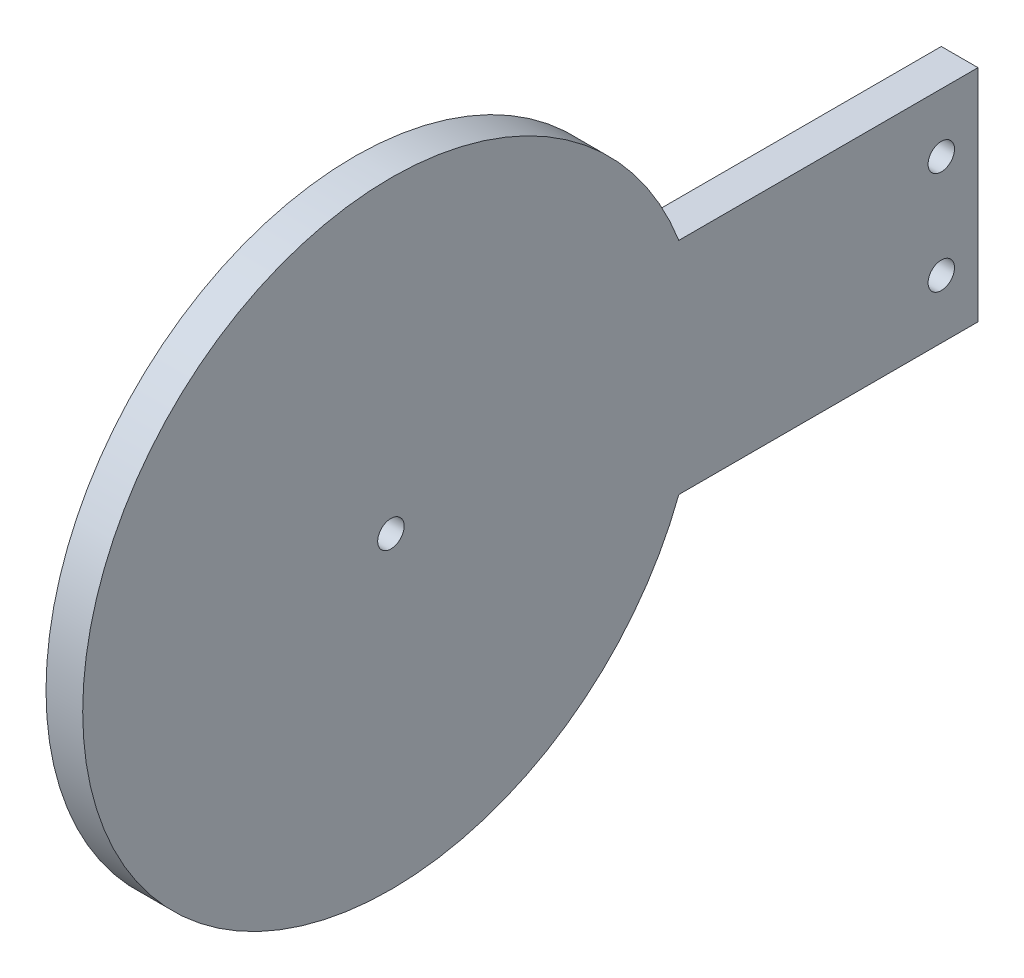
ISO-10303-21;
HEADER;
FILE_DESCRIPTION(('STEP AP214'),'2;1');
FILE_NAME('part.step','',(''),(''),'','','');
FILE_SCHEMA(('AUTOMOTIVE_DESIGN { 1 0 10303 214 1 1 1 1 }'));
ENDSEC;
DATA;
#1=APPLICATION_CONTEXT('core data for automotive mechanical design processes');
#2=APPLICATION_PROTOCOL_DEFINITION('international standard','automotive_design',2000,#1);
#3=PRODUCT_CONTEXT('',#1,'mechanical');
#4=PRODUCT('Part','Part','',(#3));
#5=PRODUCT_RELATED_PRODUCT_CATEGORY('part','',(#4));
#6=PRODUCT_DEFINITION_FORMATION('','',#4);
#7=PRODUCT_DEFINITION_CONTEXT('part definition',#1,'design');
#8=PRODUCT_DEFINITION('design','',#6,#7);
#9=PRODUCT_DEFINITION_SHAPE('','',#8);
#10=(LENGTH_UNIT() NAMED_UNIT(*) SI_UNIT(.MILLI.,.METRE.));
#11=(NAMED_UNIT(*) PLANE_ANGLE_UNIT() SI_UNIT($,.RADIAN.));
#12=(NAMED_UNIT(*) SI_UNIT($,.STERADIAN.) SOLID_ANGLE_UNIT());
#13=UNCERTAINTY_MEASURE_WITH_UNIT(LENGTH_MEASURE(1.E-05),#10,'distance_accuracy_value','');
#14=(GEOMETRIC_REPRESENTATION_CONTEXT(3) GLOBAL_UNCERTAINTY_ASSIGNED_CONTEXT((#13)) GLOBAL_UNIT_ASSIGNED_CONTEXT((#10,
#11,#12)) REPRESENTATION_CONTEXT('',''));
#15=CARTESIAN_POINT('',(0.,0.,0.));
#16=DIRECTION('',(0.,0.,1.));
#17=DIRECTION('',(1.,0.,0.));
#18=AXIS2_PLACEMENT_3D('',#15,#16,#17);
#19=CARTESIAN_POINT('',(-6.50000000000001,13.5,21.8771349286105));
#20=DIRECTION('',(-1.,0.,0.));
#21=DIRECTION('',(0.,0.,1.));
#22=AXIS2_PLACEMENT_3D('',#19,#20,#21);
#23=CYLINDRICAL_SURFACE('',#22,21.);
#24=CARTESIAN_POINT('',(-9.00000000000001,13.5,21.8771349286105));
#25=DIRECTION('',(-1.,0.,0.));
#26=DIRECTION('',(0.,0.,1.));
#27=AXIS2_PLACEMENT_3D('',#24,#25,#26);
#28=CIRCLE('',#27,21.);
#29=CARTESIAN_POINT('',(-9.00000000000001,5.99999999999999,2.26208968267751));
#30=VERTEX_POINT('',#29);
#31=CARTESIAN_POINT('',(-9.00000000000001,21.,2.26208968267751));
#32=VERTEX_POINT('',#31);
#33=EDGE_CURVE('E100',#30,#32,#28,.T.);
#34=ORIENTED_EDGE('',*,*,#33,.F.);
#35=DIRECTION('',(-1.,0.,0.));
#36=VECTOR('',#35,1.);
#37=CARTESIAN_POINT('',(-6.50000000000001,5.99999999999999,2.26208968267751));
#38=LINE('',#37,#36);
#39=CARTESIAN_POINT('',(-6.50000000000001,5.99999999999999,2.26208968267751));
#40=VERTEX_POINT('',#39);
#41=EDGE_CURVE('E11',#40,#30,#38,.T.);
#42=ORIENTED_EDGE('',*,*,#41,.F.);
#43=CARTESIAN_POINT('',(-6.50000000000001,13.5,21.8771349286105));
#44=DIRECTION('',(-1.,0.,0.));
#45=DIRECTION('',(0.,0.,1.));
#46=AXIS2_PLACEMENT_3D('',#43,#44,#45);
#47=CIRCLE('',#46,21.);
#48=CARTESIAN_POINT('',(-6.50000000000001,21.,2.26208968267751));
#49=VERTEX_POINT('',#48);
#50=EDGE_CURVE('E93',#40,#49,#47,.T.);
#51=ORIENTED_EDGE('',*,*,#50,.T.);
#52=DIRECTION('',(-1.,0.,0.));
#53=VECTOR('',#52,1.);
#54=CARTESIAN_POINT('',(-6.50000000000001,21.,2.26208968267751));
#55=LINE('',#54,#53);
#56=EDGE_CURVE('E38',#49,#32,#55,.T.);
#57=ORIENTED_EDGE('',*,*,#56,.T.);
#58=EDGE_LOOP('',(#34,#42,#51,#57));
#59=FACE_BOUND('',#58,.T.);
#60=ADVANCED_FACE('F35',(#59),#23,.T.);
#61=CARTESIAN_POINT('',(-6.50000000000001,5.99999999999999,-18.1228650713895));
#62=DIRECTION('',(0.,-1.,0.));
#63=DIRECTION('',(0.,0.,-1.));
#64=AXIS2_PLACEMENT_3D('',#61,#62,#63);
#65=PLANE('',#64);
#66=DIRECTION('',(0.,0.,1.));
#67=VECTOR('',#66,1.);
#68=CARTESIAN_POINT('',(-9.00000000000001,5.99999999999999,-18.1228650713895));
#69=LINE('',#68,#67);
#70=CARTESIAN_POINT('',(-9.00000000000001,5.99999999999999,-18.1228650713895));
#71=VERTEX_POINT('',#70);
#72=EDGE_CURVE('E95',#71,#30,#69,.T.);
#73=ORIENTED_EDGE('',*,*,#72,.F.);
#74=DIRECTION('',(-1.,0.,0.));
#75=VECTOR('',#74,1.);
#76=CARTESIAN_POINT('',(-6.50000000000001,5.99999999999999,-18.1228650713895));
#77=LINE('',#76,#75);
#78=CARTESIAN_POINT('',(-6.50000000000001,5.99999999999999,-18.1228650713895));
#79=VERTEX_POINT('',#78);
#80=EDGE_CURVE('E44',#79,#71,#77,.T.);
#81=ORIENTED_EDGE('',*,*,#80,.F.);
#82=DIRECTION('',(0.,0.,1.));
#83=VECTOR('',#82,1.);
#84=CARTESIAN_POINT('',(-6.50000000000001,5.99999999999999,-18.1228650713895));
#85=LINE('',#84,#83);
#86=EDGE_CURVE('E90',#79,#40,#85,.T.);
#87=ORIENTED_EDGE('',*,*,#86,.T.);
#88=ORIENTED_EDGE('',*,*,#41,.T.);
#89=EDGE_LOOP('',(#73,#81,#87,#88));
#90=FACE_BOUND('',#89,.T.);
#91=ADVANCED_FACE('F111',(#90),#65,.T.);
#92=CARTESIAN_POINT('',(-6.50000000000001,21.,-18.1228650713895));
#93=DIRECTION('',(0.,0.,-1.));
#94=DIRECTION('',(-1.,0.,0.));
#95=AXIS2_PLACEMENT_3D('',#92,#93,#94);
#96=PLANE('',#95);
#97=DIRECTION('',(0.,-1.,0.));
#98=VECTOR('',#97,1.);
#99=CARTESIAN_POINT('',(-9.00000000000001,21.,-18.1228650713895));
#100=LINE('',#99,#98);
#101=CARTESIAN_POINT('',(-9.00000000000001,21.,-18.1228650713895));
#102=VERTEX_POINT('',#101);
#103=EDGE_CURVE('E85',#102,#71,#100,.T.);
#104=ORIENTED_EDGE('',*,*,#103,.F.);
#105=DIRECTION('',(-1.,0.,0.));
#106=VECTOR('',#105,1.);
#107=CARTESIAN_POINT('',(-6.50000000000001,21.,-18.1228650713895));
#108=LINE('',#107,#106);
#109=CARTESIAN_POINT('',(-6.50000000000001,21.,-18.1228650713895));
#110=VERTEX_POINT('',#109);
#111=EDGE_CURVE('E80',#110,#102,#108,.T.);
#112=ORIENTED_EDGE('',*,*,#111,.F.);
#113=DIRECTION('',(0.,-1.,0.));
#114=VECTOR('',#113,1.);
#115=CARTESIAN_POINT('',(-6.50000000000001,21.,-18.1228650713895));
#116=LINE('',#115,#114);
#117=EDGE_CURVE('E83',#110,#79,#116,.T.);
#118=ORIENTED_EDGE('',*,*,#117,.T.);
#119=ORIENTED_EDGE('',*,*,#80,.T.);
#120=EDGE_LOOP('',(#104,#112,#118,#119));
#121=FACE_BOUND('',#120,.T.);
#122=ADVANCED_FACE('F82',(#121),#96,.T.);
#123=CARTESIAN_POINT('',(-6.50000000000001,21.,-18.1228650713895));
#124=DIRECTION('',(0.,1.,0.));
#125=DIRECTION('',(0.,0.,1.));
#126=AXIS2_PLACEMENT_3D('',#123,#124,#125);
#127=PLANE('',#126);
#128=DIRECTION('',(0.,0.,-1.));
#129=VECTOR('',#128,1.);
#130=CARTESIAN_POINT('',(-9.00000000000001,21.,-18.1228650713895));
#131=LINE('',#130,#129);
#132=EDGE_CURVE('E103',#32,#102,#131,.T.);
#133=ORIENTED_EDGE('',*,*,#132,.F.);
#134=ORIENTED_EDGE('',*,*,#56,.F.);
#135=DIRECTION('',(0.,0.,-1.));
#136=VECTOR('',#135,1.);
#137=CARTESIAN_POINT('',(-6.50000000000001,21.,-18.1228650713895));
#138=LINE('',#137,#136);
#139=EDGE_CURVE('E89',#49,#110,#138,.T.);
#140=ORIENTED_EDGE('',*,*,#139,.T.);
#141=ORIENTED_EDGE('',*,*,#111,.T.);
#142=EDGE_LOOP('',(#133,#134,#140,#141));
#143=FACE_BOUND('',#142,.T.);
#144=ADVANCED_FACE('F92',(#143),#127,.T.);
#145=CARTESIAN_POINT('',(-6.50000000000001,13.5,21.8771349286105));
#146=DIRECTION('',(-1.,0.,0.));
#147=DIRECTION('',(0.,0.,1.));
#148=AXIS2_PLACEMENT_3D('',#145,#146,#147);
#149=PLANE('',#148);
#150=CARTESIAN_POINT('',(-6.50000000000001,17.,-15.6228650713895));
#151=DIRECTION('',(1.,0.,0.));
#152=DIRECTION('',(0.,0.,-1.));
#153=AXIS2_PLACEMENT_3D('',#150,#151,#152);
#154=CIRCLE('',#153,0.899999999999999);
#155=CARTESIAN_POINT('',(-6.50000000000001,17.,-16.5228650713895));
#156=VERTEX_POINT('',#155);
#157=EDGE_CURVE('E151',#156,#156,#154,.T.);
#158=ORIENTED_EDGE('',*,*,#157,.F.);
#159=EDGE_LOOP('',(#158));
#160=FACE_BOUND('',#159,.T.);
#161=CARTESIAN_POINT('',(-6.50000000000001,13.5,21.8771349286105));
#162=DIRECTION('',(1.,0.,0.));
#163=DIRECTION('',(0.,0.,-1.));
#164=AXIS2_PLACEMENT_3D('',#161,#162,#163);
#165=CIRCLE('',#164,0.9);
#166=CARTESIAN_POINT('',(-6.50000000000001,13.5,20.9771349286105));
#167=VERTEX_POINT('',#166);
#168=EDGE_CURVE('E157',#167,#167,#165,.T.);
#169=ORIENTED_EDGE('',*,*,#168,.F.);
#170=EDGE_LOOP('',(#169));
#171=FACE_BOUND('',#170,.T.);
#172=CARTESIAN_POINT('',(-6.50000000000001,9.99999999999999,-15.6228650713895));
#173=DIRECTION('',(1.,0.,0.));
#174=DIRECTION('',(0.,0.,-1.));
#175=AXIS2_PLACEMENT_3D('',#172,#173,#174);
#176=CIRCLE('',#175,0.899999999999999);
#177=CARTESIAN_POINT('',(-6.50000000000001,9.99999999999999,-16.5228650713895));
#178=VERTEX_POINT('',#177);
#179=EDGE_CURVE('E154',#178,#178,#176,.T.);
#180=ORIENTED_EDGE('',*,*,#179,.F.);
#181=EDGE_LOOP('',(#180));
#182=FACE_BOUND('',#181,.T.);
#183=ORIENTED_EDGE('',*,*,#50,.F.);
#184=ORIENTED_EDGE('',*,*,#86,.F.);
#185=ORIENTED_EDGE('',*,*,#117,.F.);
#186=ORIENTED_EDGE('',*,*,#139,.F.);
#187=EDGE_LOOP('',(#183,#184,#185,#186));
#188=FACE_BOUND('',#187,.T.);
#189=ADVANCED_FACE('F88',(#160,#171,#182,#188),#149,.F.);
#190=CARTESIAN_POINT('',(-9.00000000000001,13.5,21.8771349286105));
#191=DIRECTION('',(-1.,0.,0.));
#192=DIRECTION('',(0.,0.,1.));
#193=AXIS2_PLACEMENT_3D('',#190,#191,#192);
#194=PLANE('',#193);
#195=CARTESIAN_POINT('',(-9.00000000000001,17.,-15.6228650713895));
#196=DIRECTION('',(1.,0.,0.));
#197=DIRECTION('',(0.,0.,-1.));
#198=AXIS2_PLACEMENT_3D('',#195,#196,#197);
#199=CIRCLE('',#198,0.899999999999999);
#200=CARTESIAN_POINT('',(-9.00000000000001,17.,-16.5228650713895));
#201=VERTEX_POINT('',#200);
#202=EDGE_CURVE('E149',#201,#201,#199,.T.);
#203=ORIENTED_EDGE('',*,*,#202,.T.);
#204=EDGE_LOOP('',(#203));
#205=FACE_BOUND('',#204,.T.);
#206=CARTESIAN_POINT('',(-9.00000000000001,13.5,21.8771349286105));
#207=DIRECTION('',(1.,0.,0.));
#208=DIRECTION('',(0.,0.,-1.));
#209=AXIS2_PLACEMENT_3D('',#206,#207,#208);
#210=CIRCLE('',#209,0.9);
#211=CARTESIAN_POINT('',(-9.00000000000001,13.5,20.9771349286105));
#212=VERTEX_POINT('',#211);
#213=EDGE_CURVE('E152',#212,#212,#210,.T.);
#214=ORIENTED_EDGE('',*,*,#213,.T.);
#215=EDGE_LOOP('',(#214));
#216=FACE_BOUND('',#215,.T.);
#217=CARTESIAN_POINT('',(-9.00000000000001,9.99999999999999,-15.6228650713895));
#218=DIRECTION('',(1.,0.,0.));
#219=DIRECTION('',(0.,0.,-1.));
#220=AXIS2_PLACEMENT_3D('',#217,#218,#219);
#221=CIRCLE('',#220,0.899999999999999);
#222=CARTESIAN_POINT('',(-9.00000000000001,9.99999999999999,-16.5228650713895));
#223=VERTEX_POINT('',#222);
#224=EDGE_CURVE('E104',#223,#223,#221,.T.);
#225=ORIENTED_EDGE('',*,*,#224,.T.);
#226=EDGE_LOOP('',(#225));
#227=FACE_BOUND('',#226,.T.);
#228=ORIENTED_EDGE('',*,*,#33,.T.);
#229=ORIENTED_EDGE('',*,*,#132,.T.);
#230=ORIENTED_EDGE('',*,*,#103,.T.);
#231=ORIENTED_EDGE('',*,*,#72,.T.);
#232=EDGE_LOOP('',(#228,#229,#230,#231));
#233=FACE_BOUND('',#232,.T.);
#234=ADVANCED_FACE('F110',(#205,#216,#227,#233),#194,.T.);
#235=CARTESIAN_POINT('',(-9.00000000000001,9.99999999999999,-15.6228650713895));
#236=DIRECTION('',(1.,0.,0.));
#237=DIRECTION('',(0.,0.,-1.));
#238=AXIS2_PLACEMENT_3D('',#235,#236,#237);
#239=CYLINDRICAL_SURFACE('',#238,0.899999999999999);
#240=ORIENTED_EDGE('',*,*,#224,.F.);
#241=EDGE_LOOP('',(#240));
#242=FACE_BOUND('',#241,.T.);
#243=ORIENTED_EDGE('',*,*,#179,.T.);
#244=EDGE_LOOP('',(#243));
#245=FACE_BOUND('',#244,.T.);
#246=ADVANCED_FACE('F129',(#242,#245),#239,.F.);
#247=CARTESIAN_POINT('',(-9.00000000000001,13.5,21.8771349286105));
#248=DIRECTION('',(1.,0.,0.));
#249=DIRECTION('',(0.,0.,-1.));
#250=AXIS2_PLACEMENT_3D('',#247,#248,#249);
#251=CYLINDRICAL_SURFACE('',#250,0.9);
#252=ORIENTED_EDGE('',*,*,#213,.F.);
#253=EDGE_LOOP('',(#252));
#254=FACE_BOUND('',#253,.T.);
#255=ORIENTED_EDGE('',*,*,#168,.T.);
#256=EDGE_LOOP('',(#255));
#257=FACE_BOUND('',#256,.T.);
#258=ADVANCED_FACE('F136',(#254,#257),#251,.F.);
#259=CARTESIAN_POINT('',(-9.00000000000001,17.,-15.6228650713895));
#260=DIRECTION('',(1.,0.,0.));
#261=DIRECTION('',(0.,0.,-1.));
#262=AXIS2_PLACEMENT_3D('',#259,#260,#261);
#263=CYLINDRICAL_SURFACE('',#262,0.899999999999999);
#264=ORIENTED_EDGE('',*,*,#202,.F.);
#265=EDGE_LOOP('',(#264));
#266=FACE_BOUND('',#265,.T.);
#267=ORIENTED_EDGE('',*,*,#157,.T.);
#268=EDGE_LOOP('',(#267));
#269=FACE_BOUND('',#268,.T.);
#270=ADVANCED_FACE('F140',(#266,#269),#263,.F.);
#271=CLOSED_SHELL('',(#60,#91,#122,#144,#189,#234,#246,#258,#270));
#272=MANIFOLD_SOLID_BREP('B2',#271);
#273=ADVANCED_BREP_SHAPE_REPRESENTATION('',(#18,#272),#14);
#274=SHAPE_DEFINITION_REPRESENTATION(#9,#273);
ENDSEC;
END-ISO-10303-21;
